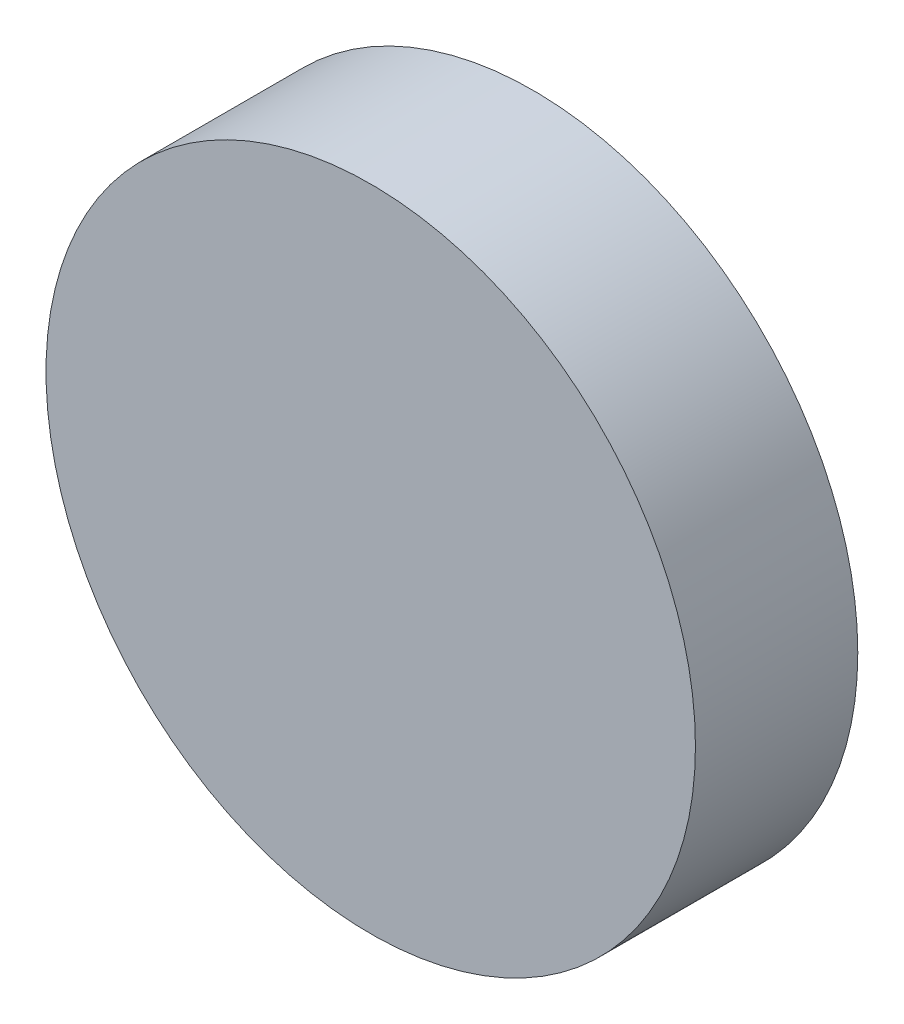
ISO-10303-21;
HEADER;
FILE_DESCRIPTION(('STEP AP214'),'2;1');
FILE_NAME('part.step','',(''),(''),'','','');
FILE_SCHEMA(('AUTOMOTIVE_DESIGN { 1 0 10303 214 1 1 1 1 }'));
ENDSEC;
DATA;
#1=APPLICATION_CONTEXT('core data for automotive mechanical design processes');
#2=APPLICATION_PROTOCOL_DEFINITION('international standard','automotive_design',2000,#1);
#3=PRODUCT_CONTEXT('',#1,'mechanical');
#4=PRODUCT('Part','Part','',(#3));
#5=PRODUCT_RELATED_PRODUCT_CATEGORY('part','',(#4));
#6=PRODUCT_DEFINITION_FORMATION('','',#4);
#7=PRODUCT_DEFINITION_CONTEXT('part definition',#1,'design');
#8=PRODUCT_DEFINITION('design','',#6,#7);
#9=PRODUCT_DEFINITION_SHAPE('','',#8);
#10=(LENGTH_UNIT() NAMED_UNIT(*) SI_UNIT(.MILLI.,.METRE.));
#11=(NAMED_UNIT(*) PLANE_ANGLE_UNIT() SI_UNIT($,.RADIAN.));
#12=(NAMED_UNIT(*) SI_UNIT($,.STERADIAN.) SOLID_ANGLE_UNIT());
#13=UNCERTAINTY_MEASURE_WITH_UNIT(LENGTH_MEASURE(1.E-05),#10,'distance_accuracy_value','');
#14=(GEOMETRIC_REPRESENTATION_CONTEXT(3) GLOBAL_UNCERTAINTY_ASSIGNED_CONTEXT((#13)) GLOBAL_UNIT_ASSIGNED_CONTEXT((#10,
#11,#12)) REPRESENTATION_CONTEXT('',''));
#15=CARTESIAN_POINT('',(0.,0.,0.));
#16=DIRECTION('',(0.,0.,1.));
#17=DIRECTION('',(1.,0.,0.));
#18=AXIS2_PLACEMENT_3D('',#15,#16,#17);
#19=CARTESIAN_POINT('',(0.,0.,20.));
#20=DIRECTION('',(0.,0.,-1.));
#21=DIRECTION('',(-1.,0.,0.));
#22=AXIS2_PLACEMENT_3D('',#19,#20,#21);
#23=CYLINDRICAL_SURFACE('',#22,40.);
#24=CARTESIAN_POINT('',(0.,0.,20.));
#25=DIRECTION('',(0.,0.,1.));
#26=DIRECTION('',(1.,0.,0.));
#27=AXIS2_PLACEMENT_3D('',#24,#25,#26);
#28=CIRCLE('',#27,40.);
#29=CARTESIAN_POINT('',(40.,0.,20.));
#30=VERTEX_POINT('',#29);
#31=EDGE_CURVE('E10',#30,#30,#28,.T.);
#32=ORIENTED_EDGE('',*,*,#31,.F.);
#33=EDGE_LOOP('',(#32));
#34=FACE_BOUND('',#33,.T.);
#35=CARTESIAN_POINT('',(0.,0.,0.));
#36=DIRECTION('',(0.,0.,1.));
#37=DIRECTION('',(1.,0.,0.));
#38=AXIS2_PLACEMENT_3D('',#35,#36,#37);
#39=CIRCLE('',#38,40.);
#40=CARTESIAN_POINT('',(40.,0.,0.));
#41=VERTEX_POINT('',#40);
#42=EDGE_CURVE('E36',#41,#41,#39,.T.);
#43=ORIENTED_EDGE('',*,*,#42,.T.);
#44=EDGE_LOOP('',(#43));
#45=FACE_BOUND('',#44,.T.);
#46=ADVANCED_FACE('F33',(#34,#45),#23,.T.);
#47=CARTESIAN_POINT('',(0.,0.,20.));
#48=DIRECTION('',(0.,0.,1.));
#49=DIRECTION('',(1.,0.,0.));
#50=AXIS2_PLACEMENT_3D('',#47,#48,#49);
#51=PLANE('',#50);
#52=ORIENTED_EDGE('',*,*,#31,.T.);
#53=EDGE_LOOP('',(#52));
#54=FACE_BOUND('',#53,.T.);
#55=ADVANCED_FACE('F49',(#54),#51,.T.);
#56=CARTESIAN_POINT('',(0.,0.,0.));
#57=DIRECTION('',(0.,0.,1.));
#58=DIRECTION('',(1.,0.,0.));
#59=AXIS2_PLACEMENT_3D('',#56,#57,#58);
#60=PLANE('',#59);
#61=ORIENTED_EDGE('',*,*,#42,.F.);
#62=EDGE_LOOP('',(#61));
#63=FACE_BOUND('',#62,.T.);
#64=ADVANCED_FACE('F47',(#63),#60,.F.);
#65=CLOSED_SHELL('',(#46,#55,#64));
#66=MANIFOLD_SOLID_BREP('B2',#65);
#67=ADVANCED_BREP_SHAPE_REPRESENTATION('',(#18,#66),#14);
#68=SHAPE_DEFINITION_REPRESENTATION(#9,#67);
ENDSEC;
END-ISO-10303-21;
